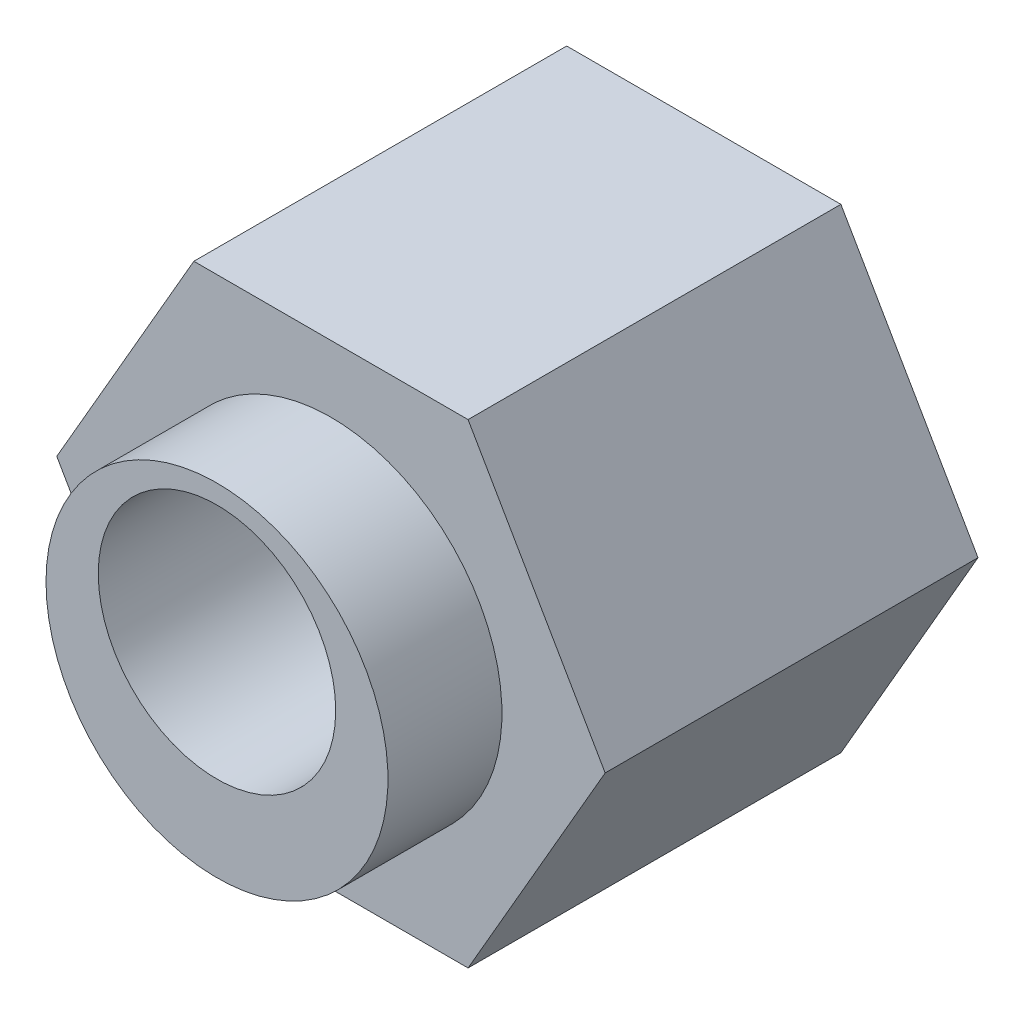
ISO-10303-21;
HEADER;
FILE_DESCRIPTION(('STEP AP214'),'2;1');
FILE_NAME('part.step','',(''),(''),'','','');
FILE_SCHEMA(('AUTOMOTIVE_DESIGN { 1 0 10303 214 1 1 1 1 }'));
ENDSEC;
DATA;
#1=APPLICATION_CONTEXT('core data for automotive mechanical design processes');
#2=APPLICATION_PROTOCOL_DEFINITION('international standard','automotive_design',2000,#1);
#3=PRODUCT_CONTEXT('',#1,'mechanical');
#4=PRODUCT('Part','Part','',(#3));
#5=PRODUCT_RELATED_PRODUCT_CATEGORY('part','',(#4));
#6=PRODUCT_DEFINITION_FORMATION('','',#4);
#7=PRODUCT_DEFINITION_CONTEXT('part definition',#1,'design');
#8=PRODUCT_DEFINITION('design','',#6,#7);
#9=PRODUCT_DEFINITION_SHAPE('','',#8);
#10=(LENGTH_UNIT() NAMED_UNIT(*) SI_UNIT(.MILLI.,.METRE.));
#11=(NAMED_UNIT(*) PLANE_ANGLE_UNIT() SI_UNIT($,.RADIAN.));
#12=(NAMED_UNIT(*) SI_UNIT($,.STERADIAN.) SOLID_ANGLE_UNIT());
#13=UNCERTAINTY_MEASURE_WITH_UNIT(LENGTH_MEASURE(1.E-05),#10,'distance_accuracy_value','');
#14=(GEOMETRIC_REPRESENTATION_CONTEXT(3) GLOBAL_UNCERTAINTY_ASSIGNED_CONTEXT((#13)) GLOBAL_UNIT_ASSIGNED_CONTEXT((#10,
#11,#12)) REPRESENTATION_CONTEXT('',''));
#15=CARTESIAN_POINT('',(0.,0.,0.));
#16=DIRECTION('',(0.,0.,1.));
#17=DIRECTION('',(1.,0.,0.));
#18=AXIS2_PLACEMENT_3D('',#15,#16,#17);
#19=CARTESIAN_POINT('',(0.,0.7,0.45));
#20=DIRECTION('',(0.,0.,-1.));
#21=DIRECTION('',(-1.,0.,0.));
#22=AXIS2_PLACEMENT_3D('',#19,#20,#21);
#23=PLANE('',#22);
#24=CARTESIAN_POINT('',(0.,0.7,0.45));
#25=DIRECTION('',(0.,0.,-1.));
#26=DIRECTION('',(-1.,0.,0.));
#27=AXIS2_PLACEMENT_3D('',#24,#25,#26);
#28=CIRCLE('',#27,3.6);
#29=CARTESIAN_POINT('',(-3.6,0.7,0.45));
#30=VERTEX_POINT('',#29);
#31=EDGE_CURVE('E20',#30,#30,#28,.T.);
#32=ORIENTED_EDGE('',*,*,#31,.F.);
#33=EDGE_LOOP('',(#32));
#34=FACE_BOUND('',#33,.T.);
#35=DIRECTION('',(0.5,-0.866025403784439,0.));
#36=VECTOR('',#35,1.);
#37=CARTESIAN_POINT('',(-5.77350269189626,0.,0.45));
#38=LINE('',#37,#36);
#39=CARTESIAN_POINT('',(-5.77350269189626,0.,0.45));
#40=VERTEX_POINT('',#39);
#41=CARTESIAN_POINT('',(-2.88675134594813,-5.,0.45));
#42=VERTEX_POINT('',#41);
#43=EDGE_CURVE('E68',#40,#42,#38,.T.);
#44=ORIENTED_EDGE('',*,*,#43,.F.);
#45=DIRECTION('',(-0.500000000000001,-0.866025403784438,0.));
#46=VECTOR('',#45,1.);
#47=CARTESIAN_POINT('',(-2.88675134594812,5.,0.45));
#48=LINE('',#47,#46);
#49=CARTESIAN_POINT('',(-2.88675134594813,5.,0.45));
#50=VERTEX_POINT('',#49);
#51=EDGE_CURVE('E75',#50,#40,#48,.T.);
#52=ORIENTED_EDGE('',*,*,#51,.F.);
#53=DIRECTION('',(1.,0.,0.));
#54=VECTOR('',#53,1.);
#55=CARTESIAN_POINT('',(2.88675134594813,5.,0.45));
#56=LINE('',#55,#54);
#57=CARTESIAN_POINT('',(2.88675134594813,5.,0.45));
#58=VERTEX_POINT('',#57);
#59=EDGE_CURVE('E124',#58,#50,#56,.F.);
#60=ORIENTED_EDGE('',*,*,#59,.F.);
#61=DIRECTION('',(-0.5,0.866025403784439,0.));
#62=VECTOR('',#61,1.);
#63=CARTESIAN_POINT('',(5.77350269189626,0.,0.45));
#64=LINE('',#63,#62);
#65=CARTESIAN_POINT('',(5.77350269189626,0.,0.45));
#66=VERTEX_POINT('',#65);
#67=EDGE_CURVE('E129',#66,#58,#64,.T.);
#68=ORIENTED_EDGE('',*,*,#67,.F.);
#69=DIRECTION('',(0.500000000000001,0.866025403784438,0.));
#70=VECTOR('',#69,1.);
#71=CARTESIAN_POINT('',(2.88675134594812,-5.,0.45));
#72=LINE('',#71,#70);
#73=CARTESIAN_POINT('',(2.88675134594813,-5.,0.45));
#74=VERTEX_POINT('',#73);
#75=EDGE_CURVE('E134',#74,#66,#72,.T.);
#76=ORIENTED_EDGE('',*,*,#75,.F.);
#77=DIRECTION('',(1.,0.,0.));
#78=VECTOR('',#77,1.);
#79=CARTESIAN_POINT('',(-2.88675134594813,-5.,0.45));
#80=LINE('',#79,#78);
#81=EDGE_CURVE('E89',#42,#74,#80,.T.);
#82=ORIENTED_EDGE('',*,*,#81,.F.);
#83=EDGE_LOOP('',(#44,#52,#60,#68,#76,#82));
#84=FACE_BOUND('',#83,.T.);
#85=ADVANCED_FACE('F17',(#34,#84),#23,.T.);
#86=CARTESIAN_POINT('',(0.,0.7,0.45));
#87=DIRECTION('',(0.,0.,-1.));
#88=DIRECTION('',(-1.,0.,0.));
#89=AXIS2_PLACEMENT_3D('',#86,#87,#88);
#90=CYLINDRICAL_SURFACE('',#89,3.6);
#91=ORIENTED_EDGE('',*,*,#31,.T.);
#92=EDGE_LOOP('',(#91));
#93=FACE_BOUND('',#92,.T.);
#94=CARTESIAN_POINT('',(0.,0.7,0.0500000000442924));
#95=DIRECTION('',(0.,0.,1.));
#96=DIRECTION('',(1.,0.,0.));
#97=AXIS2_PLACEMENT_3D('',#94,#95,#96);
#98=CIRCLE('',#97,3.60000000000582);
#99=CARTESIAN_POINT('',(3.60000000000582,0.7,0.0500000000442924));
#100=VERTEX_POINT('',#99);
#101=EDGE_CURVE('E95',#100,#100,#98,.F.);
#102=ORIENTED_EDGE('',*,*,#101,.F.);
#103=EDGE_LOOP('',(#102));
#104=FACE_BOUND('',#103,.T.);
#105=ADVANCED_FACE('F274',(#93,#104),#90,.T.);
#106=CARTESIAN_POINT('',(-2.88675134594812,5.,-0.0499999999999997));
#107=DIRECTION('',(-0.866025403784438,0.500000000000001,0.));
#108=DIRECTION('',(-0.500000000000001,-0.866025403784438,0.));
#109=AXIS2_PLACEMENT_3D('',#106,#107,#108);
#110=PLANE('',#109);
#111=DIRECTION('',(0.,0.,1.));
#112=VECTOR('',#111,1.);
#113=CARTESIAN_POINT('',(-5.77350269189626,0.,-0.0499999999999997));
#114=LINE('',#113,#112);
#115=CARTESIAN_POINT('',(-5.77350269189626,0.,8.3));
#116=VERTEX_POINT('',#115);
#117=EDGE_CURVE('E78',#116,#40,#114,.F.);
#118=ORIENTED_EDGE('',*,*,#117,.F.);
#119=DIRECTION('',(-0.500000000000001,-0.866025403784438,0.));
#120=VECTOR('',#119,1.);
#121=CARTESIAN_POINT('',(-2.88675134594812,5.,8.3));
#122=LINE('',#121,#120);
#123=CARTESIAN_POINT('',(-2.88675134594813,5.,8.3));
#124=VERTEX_POINT('',#123);
#125=EDGE_CURVE('E97',#124,#116,#122,.T.);
#126=ORIENTED_EDGE('',*,*,#125,.F.);
#127=DIRECTION('',(0.,0.,1.));
#128=VECTOR('',#127,1.);
#129=CARTESIAN_POINT('',(-2.88675134594813,5.,-0.0499999999999997));
#130=LINE('',#129,#128);
#131=EDGE_CURVE('E80',#50,#124,#130,.T.);
#132=ORIENTED_EDGE('',*,*,#131,.F.);
#133=ORIENTED_EDGE('',*,*,#51,.T.);
#134=EDGE_LOOP('',(#118,#126,#132,#133));
#135=FACE_BOUND('',#134,.T.);
#136=ADVANCED_FACE('F76',(#135),#110,.T.);
#137=CARTESIAN_POINT('',(-5.77350269189626,0.,-0.0499999999999997));
#138=DIRECTION('',(-0.866025403784439,-0.5,0.));
#139=DIRECTION('',(0.5,-0.866025403784439,0.));
#140=AXIS2_PLACEMENT_3D('',#137,#138,#139);
#141=PLANE('',#140);
#142=DIRECTION('',(0.,0.,-1.));
#143=VECTOR('',#142,1.);
#144=CARTESIAN_POINT('',(-2.88675134594813,-5.,-0.0499999999999997));
#145=LINE('',#144,#143);
#146=CARTESIAN_POINT('',(-2.88675134594813,-5.,8.3));
#147=VERTEX_POINT('',#146);
#148=EDGE_CURVE('E90',#147,#42,#145,.T.);
#149=ORIENTED_EDGE('',*,*,#148,.F.);
#150=DIRECTION('',(0.5,-0.866025403784439,0.));
#151=VECTOR('',#150,1.);
#152=CARTESIAN_POINT('',(-5.77350269189626,0.,8.3));
#153=LINE('',#152,#151);
#154=EDGE_CURVE('E85',#116,#147,#153,.T.);
#155=ORIENTED_EDGE('',*,*,#154,.F.);
#156=ORIENTED_EDGE('',*,*,#117,.T.);
#157=ORIENTED_EDGE('',*,*,#43,.T.);
#158=EDGE_LOOP('',(#149,#155,#156,#157));
#159=FACE_BOUND('',#158,.T.);
#160=ADVANCED_FACE('F84',(#159),#141,.T.);
#161=CARTESIAN_POINT('',(-2.88675134594813,-5.,-0.0499999999999997));
#162=DIRECTION('',(0.,-1.,0.));
#163=DIRECTION('',(0.,0.,-1.));
#164=AXIS2_PLACEMENT_3D('',#161,#162,#163);
#165=PLANE('',#164);
#166=DIRECTION('',(0.,0.,1.));
#167=VECTOR('',#166,1.);
#168=CARTESIAN_POINT('',(2.88675134594812,-5.,-0.0499999999999997));
#169=LINE('',#168,#167);
#170=CARTESIAN_POINT('',(2.88675134594813,-5.,8.3));
#171=VERTEX_POINT('',#170);
#172=EDGE_CURVE('E136',#171,#74,#169,.F.);
#173=ORIENTED_EDGE('',*,*,#172,.F.);
#174=DIRECTION('',(1.,0.,0.));
#175=VECTOR('',#174,1.);
#176=CARTESIAN_POINT('',(0.,-5.,8.3));
#177=LINE('',#176,#175);
#178=EDGE_CURVE('E119',#147,#171,#177,.T.);
#179=ORIENTED_EDGE('',*,*,#178,.F.);
#180=ORIENTED_EDGE('',*,*,#148,.T.);
#181=ORIENTED_EDGE('',*,*,#81,.T.);
#182=EDGE_LOOP('',(#173,#179,#180,#181));
#183=FACE_BOUND('',#182,.T.);
#184=ADVANCED_FACE('F140',(#183),#165,.T.);
#185=CARTESIAN_POINT('',(2.88675134594812,-5.,-0.0499999999999997));
#186=DIRECTION('',(0.866025403784438,-0.500000000000001,0.));
#187=DIRECTION('',(0.500000000000001,0.866025403784438,0.));
#188=AXIS2_PLACEMENT_3D('',#185,#186,#187);
#189=PLANE('',#188);
#190=DIRECTION('',(0.,0.,1.));
#191=VECTOR('',#190,1.);
#192=CARTESIAN_POINT('',(5.77350269189626,0.,-0.0499999999999997));
#193=LINE('',#192,#191);
#194=CARTESIAN_POINT('',(5.77350269189626,0.,8.3));
#195=VERTEX_POINT('',#194);
#196=EDGE_CURVE('E131',#195,#66,#193,.F.);
#197=ORIENTED_EDGE('',*,*,#196,.F.);
#198=DIRECTION('',(0.500000000000001,0.866025403784438,0.));
#199=VECTOR('',#198,1.);
#200=CARTESIAN_POINT('',(2.88675134594812,-5.,8.3));
#201=LINE('',#200,#199);
#202=EDGE_CURVE('E114',#171,#195,#201,.T.);
#203=ORIENTED_EDGE('',*,*,#202,.F.);
#204=ORIENTED_EDGE('',*,*,#172,.T.);
#205=ORIENTED_EDGE('',*,*,#75,.T.);
#206=EDGE_LOOP('',(#197,#203,#204,#205));
#207=FACE_BOUND('',#206,.T.);
#208=ADVANCED_FACE('F145',(#207),#189,.T.);
#209=CARTESIAN_POINT('',(5.77350269189626,0.,-0.0499999999999997));
#210=DIRECTION('',(0.866025403784439,0.5,0.));
#211=DIRECTION('',(-0.5,0.866025403784439,0.));
#212=AXIS2_PLACEMENT_3D('',#209,#210,#211);
#213=PLANE('',#212);
#214=DIRECTION('',(0.,0.,1.));
#215=VECTOR('',#214,1.);
#216=CARTESIAN_POINT('',(2.88675134594813,5.,-0.0499999999999997));
#217=LINE('',#216,#215);
#218=CARTESIAN_POINT('',(2.88675134594813,5.,8.3));
#219=VERTEX_POINT('',#218);
#220=EDGE_CURVE('E126',#219,#58,#217,.F.);
#221=ORIENTED_EDGE('',*,*,#220,.F.);
#222=DIRECTION('',(-0.5,0.866025403784439,0.));
#223=VECTOR('',#222,1.);
#224=CARTESIAN_POINT('',(5.77350269189626,0.,8.3));
#225=LINE('',#224,#223);
#226=EDGE_CURVE('E35',#195,#219,#225,.T.);
#227=ORIENTED_EDGE('',*,*,#226,.F.);
#228=ORIENTED_EDGE('',*,*,#196,.T.);
#229=ORIENTED_EDGE('',*,*,#67,.T.);
#230=EDGE_LOOP('',(#221,#227,#228,#229));
#231=FACE_BOUND('',#230,.T.);
#232=ADVANCED_FACE('F148',(#231),#213,.T.);
#233=CARTESIAN_POINT('',(2.88675134594813,5.,-0.0499999999999997));
#234=DIRECTION('',(0.,1.,0.));
#235=DIRECTION('',(0.,0.,1.));
#236=AXIS2_PLACEMENT_3D('',#233,#234,#235);
#237=PLANE('',#236);
#238=ORIENTED_EDGE('',*,*,#131,.T.);
#239=DIRECTION('',(1.,0.,0.));
#240=VECTOR('',#239,1.);
#241=CARTESIAN_POINT('',(0.,5.,8.3));
#242=LINE('',#241,#240);
#243=EDGE_CURVE('E109',#219,#124,#242,.F.);
#244=ORIENTED_EDGE('',*,*,#243,.F.);
#245=ORIENTED_EDGE('',*,*,#220,.T.);
#246=ORIENTED_EDGE('',*,*,#59,.T.);
#247=EDGE_LOOP('',(#238,#244,#245,#246));
#248=FACE_BOUND('',#247,.T.);
#249=ADVANCED_FACE('F150',(#248),#237,.T.);
#250=CARTESIAN_POINT('',(0.,0.7,0.0500000000442924));
#251=DIRECTION('',(0.,0.,1.));
#252=DIRECTION('',(1.,0.,0.));
#253=AXIS2_PLACEMENT_3D('',#250,#251,#252);
#254=CONICAL_SURFACE('',#253,3.60000000000582,0.785398163397448);
#255=CARTESIAN_POINT('',(0.,0.7,-0.049999999987449));
#256=DIRECTION('',(0.,0.,1.));
#257=DIRECTION('',(1.,0.,0.));
#258=AXIS2_PLACEMENT_3D('',#255,#256,#257);
#259=CIRCLE('',#258,3.49999999997408);
#260=CARTESIAN_POINT('',(3.49999999997408,0.7,-0.049999999987449));
#261=VERTEX_POINT('',#260);
#262=EDGE_CURVE('E107',#261,#261,#259,.T.);
#263=ORIENTED_EDGE('',*,*,#262,.T.);
#264=EDGE_LOOP('',(#263));
#265=FACE_BOUND('',#264,.T.);
#266=ORIENTED_EDGE('',*,*,#101,.T.);
#267=EDGE_LOOP('',(#266));
#268=FACE_BOUND('',#267,.T.);
#269=ADVANCED_FACE('F152',(#265,#268),#254,.T.);
#270=CARTESIAN_POINT('',(0.,0.,8.3));
#271=DIRECTION('',(0.,0.,1.));
#272=DIRECTION('',(1.,0.,0.));
#273=AXIS2_PLACEMENT_3D('',#270,#271,#272);
#274=PLANE('',#273);
#275=ORIENTED_EDGE('',*,*,#226,.T.);
#276=ORIENTED_EDGE('',*,*,#243,.T.);
#277=ORIENTED_EDGE('',*,*,#125,.T.);
#278=ORIENTED_EDGE('',*,*,#154,.T.);
#279=ORIENTED_EDGE('',*,*,#178,.T.);
#280=ORIENTED_EDGE('',*,*,#202,.T.);
#281=EDGE_LOOP('',(#275,#276,#277,#278,#279,#280));
#282=FACE_BOUND('',#281,.T.);
#283=CARTESIAN_POINT('',(0.,0.,8.3));
#284=DIRECTION('',(0.,0.,-1.));
#285=DIRECTION('',(-1.,0.,0.));
#286=AXIS2_PLACEMENT_3D('',#283,#284,#285);
#287=CIRCLE('',#286,3.6);
#288=CARTESIAN_POINT('',(-3.6,0.,8.3));
#289=VERTEX_POINT('',#288);
#290=EDGE_CURVE('E105',#289,#289,#287,.F.);
#291=ORIENTED_EDGE('',*,*,#290,.F.);
#292=EDGE_LOOP('',(#291));
#293=FACE_BOUND('',#292,.T.);
#294=ADVANCED_FACE('F159',(#282,#293),#274,.T.);
#295=CARTESIAN_POINT('',(0.,0.,-0.0499999999999997));
#296=DIRECTION('',(0.,0.,1.));
#297=DIRECTION('',(1.,0.,0.));
#298=AXIS2_PLACEMENT_3D('',#295,#296,#297);
#299=PLANE('',#298);
#300=ORIENTED_EDGE('',*,*,#262,.F.);
#301=EDGE_LOOP('',(#300));
#302=FACE_BOUND('',#301,.T.);
#303=CARTESIAN_POINT('',(0.,0.7,-0.0500000000442924));
#304=DIRECTION('',(0.,0.,-1.));
#305=DIRECTION('',(-1.,0.,0.));
#306=AXIS2_PLACEMENT_3D('',#303,#304,#305);
#307=CIRCLE('',#306,2.59999999997262);
#308=CARTESIAN_POINT('',(-2.59999999997262,0.7,-0.0500000000442924));
#309=VERTEX_POINT('',#308);
#310=EDGE_CURVE('E102',#309,#309,#307,.F.);
#311=ORIENTED_EDGE('',*,*,#310,.T.);
#312=EDGE_LOOP('',(#311));
#313=FACE_BOUND('',#312,.T.);
#314=ADVANCED_FACE('F182',(#302,#313),#299,.F.);
#315=CARTESIAN_POINT('',(0.,0.,10.7));
#316=DIRECTION('',(0.,0.,-1.));
#317=DIRECTION('',(-1.,0.,0.));
#318=AXIS2_PLACEMENT_3D('',#315,#316,#317);
#319=CYLINDRICAL_SURFACE('',#318,3.6);
#320=CARTESIAN_POINT('',(0.,0.,10.7));
#321=DIRECTION('',(0.,0.,-1.));
#322=DIRECTION('',(-1.,0.,0.));
#323=AXIS2_PLACEMENT_3D('',#320,#321,#322);
#324=CIRCLE('',#323,3.6);
#325=CARTESIAN_POINT('',(-3.6,0.,10.7));
#326=VERTEX_POINT('',#325);
#327=EDGE_CURVE('E99',#326,#326,#324,.F.);
#328=ORIENTED_EDGE('',*,*,#327,.F.);
#329=EDGE_LOOP('',(#328));
#330=FACE_BOUND('',#329,.T.);
#331=ORIENTED_EDGE('',*,*,#290,.T.);
#332=EDGE_LOOP('',(#331));
#333=FACE_BOUND('',#332,.T.);
#334=ADVANCED_FACE('F178',(#330,#333),#319,.T.);
#335=CARTESIAN_POINT('',(0.,0.7,-0.0500000000442924));
#336=DIRECTION('',(0.,0.,-1.));
#337=DIRECTION('',(-1.,0.,0.));
#338=AXIS2_PLACEMENT_3D('',#335,#336,#337);
#339=CONICAL_SURFACE('',#338,2.59999999997262,0.785398163113231);
#340=ORIENTED_EDGE('',*,*,#310,.F.);
#341=EDGE_LOOP('',(#340));
#342=FACE_BOUND('',#341,.T.);
#343=CARTESIAN_POINT('',(0.,0.7,0.0499999999999971));
#344=DIRECTION('',(0.,0.,-1.));
#345=DIRECTION('',(-1.,0.,0.));
#346=AXIS2_PLACEMENT_3D('',#343,#344,#345);
#347=CIRCLE('',#346,2.49999999999999);
#348=CARTESIAN_POINT('',(-2.49999999999999,0.7,0.0499999999999971));
#349=VERTEX_POINT('',#348);
#350=EDGE_CURVE('E26',#349,#349,#347,.F.);
#351=ORIENTED_EDGE('',*,*,#350,.T.);
#352=EDGE_LOOP('',(#351));
#353=FACE_BOUND('',#352,.T.);
#354=ADVANCED_FACE('F170',(#342,#353),#339,.F.);
#355=CARTESIAN_POINT('',(3.6,0.,10.7));
#356=DIRECTION('',(0.,0.,1.));
#357=DIRECTION('',(1.,0.,0.));
#358=AXIS2_PLACEMENT_3D('',#355,#356,#357);
#359=PLANE('',#358);
#360=ORIENTED_EDGE('',*,*,#327,.T.);
#361=EDGE_LOOP('',(#360));
#362=FACE_BOUND('',#361,.T.);
#363=CARTESIAN_POINT('',(0.,0.7,10.7));
#364=DIRECTION('',(0.,0.,-1.));
#365=DIRECTION('',(-1.,0.,0.));
#366=AXIS2_PLACEMENT_3D('',#363,#364,#365);
#367=CIRCLE('',#366,2.49999999999999);
#368=CARTESIAN_POINT('',(-2.49999999999999,0.7,10.7));
#369=VERTEX_POINT('',#368);
#370=EDGE_CURVE('E10',#369,#369,#367,.T.);
#371=ORIENTED_EDGE('',*,*,#370,.T.);
#372=EDGE_LOOP('',(#371));
#373=FACE_BOUND('',#372,.T.);
#374=ADVANCED_FACE('F164',(#362,#373),#359,.T.);
#375=CARTESIAN_POINT('',(0.,0.7,-0.0499999999999997));
#376=DIRECTION('',(0.,0.,-1.));
#377=DIRECTION('',(-1.,0.,0.));
#378=AXIS2_PLACEMENT_3D('',#375,#376,#377);
#379=CYLINDRICAL_SURFACE('',#378,2.49999999999999);
#380=ORIENTED_EDGE('',*,*,#350,.F.);
#381=EDGE_LOOP('',(#380));
#382=FACE_BOUND('',#381,.T.);
#383=ORIENTED_EDGE('',*,*,#370,.F.);
#384=EDGE_LOOP('',(#383));
#385=FACE_BOUND('',#384,.T.);
#386=ADVANCED_FACE('F162',(#382,#385),#379,.F.);
#387=CLOSED_SHELL('',(#85,#105,#136,#160,#184,#208,#232,#249,#269,#294,#314,#334,#354,#374,#386));
#388=MANIFOLD_SOLID_BREP('B1',#387);
#389=ADVANCED_BREP_SHAPE_REPRESENTATION('',(#18,#388),#14);
#390=SHAPE_DEFINITION_REPRESENTATION(#9,#389);
ENDSEC;
END-ISO-10303-21;
